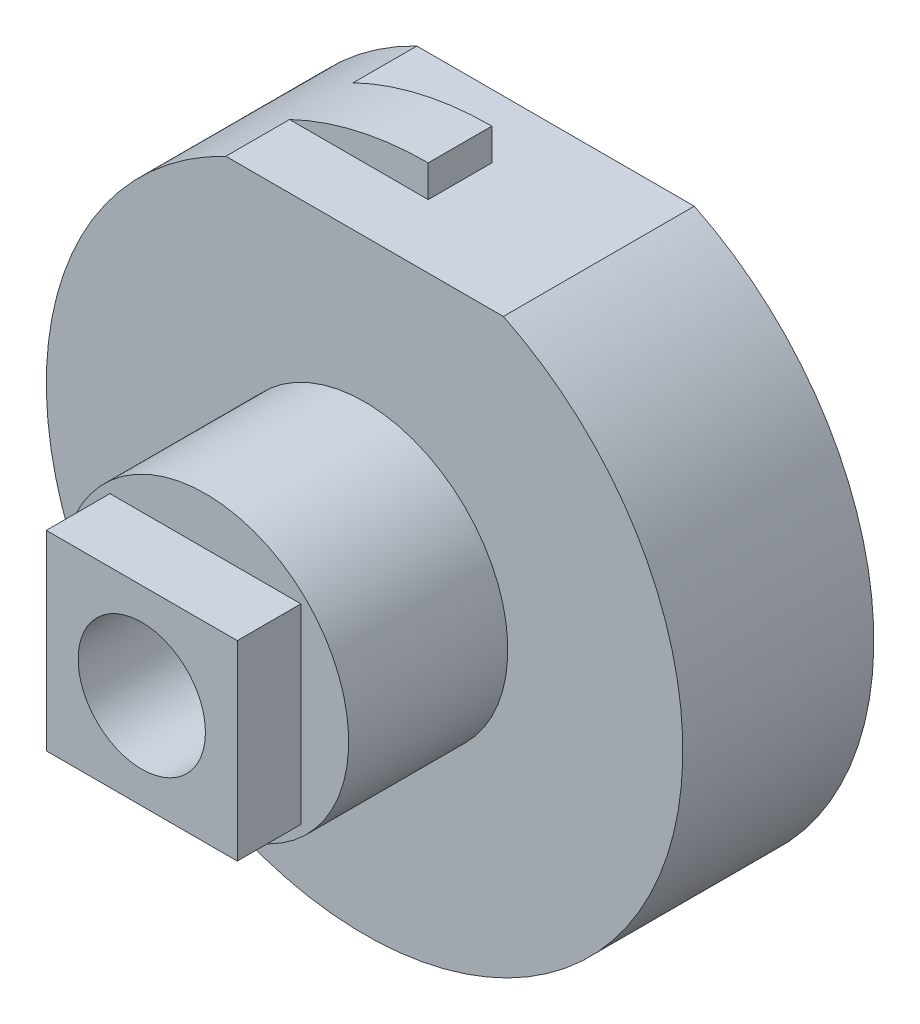
ISO-10303-21;
HEADER;
FILE_DESCRIPTION(('STEP AP214'),'2;1');
FILE_NAME('part.step','',(''),(''),'','','');
FILE_SCHEMA(('AUTOMOTIVE_DESIGN { 1 0 10303 214 1 1 1 1 }'));
ENDSEC;
DATA;
#1=APPLICATION_CONTEXT('core data for automotive mechanical design processes');
#2=APPLICATION_PROTOCOL_DEFINITION('international standard','automotive_design',2000,#1);
#3=PRODUCT_CONTEXT('',#1,'mechanical');
#4=PRODUCT('Part','Part','',(#3));
#5=PRODUCT_RELATED_PRODUCT_CATEGORY('part','',(#4));
#6=PRODUCT_DEFINITION_FORMATION('','',#4);
#7=PRODUCT_DEFINITION_CONTEXT('part definition',#1,'design');
#8=PRODUCT_DEFINITION('design','',#6,#7);
#9=PRODUCT_DEFINITION_SHAPE('','',#8);
#10=(LENGTH_UNIT() NAMED_UNIT(*) SI_UNIT(.MILLI.,.METRE.));
#11=(NAMED_UNIT(*) PLANE_ANGLE_UNIT() SI_UNIT($,.RADIAN.));
#12=(NAMED_UNIT(*) SI_UNIT($,.STERADIAN.) SOLID_ANGLE_UNIT());
#13=UNCERTAINTY_MEASURE_WITH_UNIT(LENGTH_MEASURE(1.E-05),#10,'distance_accuracy_value','');
#14=(GEOMETRIC_REPRESENTATION_CONTEXT(3) GLOBAL_UNCERTAINTY_ASSIGNED_CONTEXT((#13)) GLOBAL_UNIT_ASSIGNED_CONTEXT((#10,
#11,#12)) REPRESENTATION_CONTEXT('',''));
#15=CARTESIAN_POINT('',(0.,0.,0.));
#16=DIRECTION('',(0.,0.,1.));
#17=DIRECTION('',(1.,0.,0.));
#18=AXIS2_PLACEMENT_3D('',#15,#16,#17);
#19=CARTESIAN_POINT('',(0.,0.,-2.75));
#20=DIRECTION('',(0.,0.,-1.));
#21=DIRECTION('',(-1.,0.,0.));
#22=AXIS2_PLACEMENT_3D('',#19,#20,#21);
#23=PLANE('',#22);
#24=CARTESIAN_POINT('',(0.,0.,-2.75));
#25=DIRECTION('',(0.,0.,-1.));
#26=DIRECTION('',(-1.,0.,0.));
#27=AXIS2_PLACEMENT_3D('',#24,#25,#26);
#28=CIRCLE('',#27,1.25);
#29=CARTESIAN_POINT('',(-1.25,0.,-2.75));
#30=VERTEX_POINT('',#29);
#31=EDGE_CURVE('E185',#30,#30,#28,.T.);
#32=ORIENTED_EDGE('',*,*,#31,.F.);
#33=EDGE_LOOP('',(#32));
#34=FACE_BOUND('',#33,.T.);
#35=CARTESIAN_POINT('',(0.,0.,-2.75));
#36=DIRECTION('',(0.,0.,-1.));
#37=DIRECTION('',(-1.,0.,0.));
#38=AXIS2_PLACEMENT_3D('',#35,#36,#37);
#39=CIRCLE('',#38,2.5);
#40=CARTESIAN_POINT('',(1.08972473588517,2.25,-2.75));
#41=VERTEX_POINT('',#40);
#42=CARTESIAN_POINT('',(-1.08972473588517,2.25,-2.75));
#43=VERTEX_POINT('',#42);
#44=EDGE_CURVE('E194',#41,#43,#39,.T.);
#45=ORIENTED_EDGE('',*,*,#44,.T.);
#46=DIRECTION('',(-1.,0.,0.));
#47=VECTOR('',#46,1.);
#48=CARTESIAN_POINT('',(1.5,2.25,-2.75));
#49=LINE('',#48,#47);
#50=EDGE_CURVE('E294',#41,#43,#49,.T.);
#51=ORIENTED_EDGE('',*,*,#50,.F.);
#52=EDGE_LOOP('',(#45,#51));
#53=FACE_BOUND('',#52,.T.);
#54=ADVANCED_FACE('F36',(#34,#53),#23,.T.);
#55=CARTESIAN_POINT('',(0.,0.,-1.25));
#56=DIRECTION('',(0.,0.,-1.));
#57=DIRECTION('',(-1.,0.,0.));
#58=AXIS2_PLACEMENT_3D('',#55,#56,#57);
#59=PLANE('',#58);
#60=CARTESIAN_POINT('',(0.,0.,-1.25));
#61=DIRECTION('',(0.,0.,-1.));
#62=DIRECTION('',(-1.,0.,0.));
#63=AXIS2_PLACEMENT_3D('',#60,#61,#62);
#64=CIRCLE('',#63,1.125);
#65=CARTESIAN_POINT('',(-1.125,0.,-1.25));
#66=VERTEX_POINT('',#65);
#67=EDGE_CURVE('E116',#66,#66,#64,.T.);
#68=ORIENTED_EDGE('',*,*,#67,.T.);
#69=EDGE_LOOP('',(#68));
#70=FACE_BOUND('',#69,.T.);
#71=DIRECTION('',(1.,0.,0.));
#72=VECTOR('',#71,1.);
#73=CARTESIAN_POINT('',(1.5,2.25,-1.25));
#74=LINE('',#73,#72);
#75=CARTESIAN_POINT('',(-1.08972473588517,2.25,-1.25));
#76=VERTEX_POINT('',#75);
#77=CARTESIAN_POINT('',(1.08972473588517,2.25,-1.25));
#78=VERTEX_POINT('',#77);
#79=EDGE_CURVE('E53',#76,#78,#74,.T.);
#80=ORIENTED_EDGE('',*,*,#79,.F.);
#81=CARTESIAN_POINT('',(0.,0.,-1.25));
#82=DIRECTION('',(0.,0.,-1.));
#83=DIRECTION('',(-1.,0.,0.));
#84=AXIS2_PLACEMENT_3D('',#81,#82,#83);
#85=CIRCLE('',#84,2.5);
#86=EDGE_CURVE('E191',#78,#76,#85,.T.);
#87=ORIENTED_EDGE('',*,*,#86,.F.);
#88=EDGE_LOOP('',(#80,#87));
#89=FACE_BOUND('',#88,.T.);
#90=ADVANCED_FACE('F221',(#70,#89),#59,.F.);
#91=CARTESIAN_POINT('',(0.,0.,-2.75));
#92=DIRECTION('',(0.,0.,1.));
#93=DIRECTION('',(1.,0.,0.));
#94=AXIS2_PLACEMENT_3D('',#91,#92,#93);
#95=CYLINDRICAL_SURFACE('',#94,2.5);
#96=DIRECTION('',(0.,0.,1.));
#97=VECTOR('',#96,1.);
#98=CARTESIAN_POINT('',(-1.08972473588517,2.25,-2.75));
#99=LINE('',#98,#97);
#100=CARTESIAN_POINT('',(-1.08972473588517,2.25,-2.25));
#101=VERTEX_POINT('',#100);
#102=EDGE_CURVE('E11',#43,#101,#99,.T.);
#103=ORIENTED_EDGE('',*,*,#102,.F.);
#104=ORIENTED_EDGE('',*,*,#44,.F.);
#105=DIRECTION('',(0.,0.,1.));
#106=VECTOR('',#105,1.);
#107=CARTESIAN_POINT('',(1.08972473588517,2.25,-2.75));
#108=LINE('',#107,#106);
#109=EDGE_CURVE('E126',#78,#41,#108,.F.);
#110=ORIENTED_EDGE('',*,*,#109,.F.);
#111=ORIENTED_EDGE('',*,*,#86,.T.);
#112=CARTESIAN_POINT('',(-1.08972473588517,2.25,-1.75));
#113=VERTEX_POINT('',#112);
#114=EDGE_CURVE('E46',#113,#76,#99,.T.);
#115=ORIENTED_EDGE('',*,*,#114,.F.);
#116=CARTESIAN_POINT('',(0.,0.,-1.75));
#117=DIRECTION('',(0.,0.,1.));
#118=DIRECTION('',(1.,0.,0.));
#119=AXIS2_PLACEMENT_3D('',#116,#117,#118);
#120=CIRCLE('',#119,2.5);
#121=CARTESIAN_POINT('',(0.,2.5,-1.75));
#122=VERTEX_POINT('',#121);
#123=EDGE_CURVE('E128',#122,#113,#120,.T.);
#124=ORIENTED_EDGE('',*,*,#123,.F.);
#125=DIRECTION('',(0.,0.,1.));
#126=VECTOR('',#125,1.);
#127=CARTESIAN_POINT('',(0.,2.5,-2.75));
#128=LINE('',#127,#126);
#129=CARTESIAN_POINT('',(0.,2.5,-2.25));
#130=VERTEX_POINT('',#129);
#131=EDGE_CURVE('E130',#130,#122,#128,.T.);
#132=ORIENTED_EDGE('',*,*,#131,.F.);
#133=CARTESIAN_POINT('',(0.,0.,-2.25));
#134=DIRECTION('',(0.,0.,-1.));
#135=DIRECTION('',(-1.,0.,0.));
#136=AXIS2_PLACEMENT_3D('',#133,#134,#135);
#137=CIRCLE('',#136,2.5);
#138=EDGE_CURVE('E40',#101,#130,#137,.T.);
#139=ORIENTED_EDGE('',*,*,#138,.F.);
#140=EDGE_LOOP('',(#103,#104,#110,#111,#115,#124,#132,#139));
#141=FACE_BOUND('',#140,.T.);
#142=ADVANCED_FACE('F161',(#141),#95,.T.);
#143=CARTESIAN_POINT('',(0.,0.,-3.));
#144=DIRECTION('',(0.,0.,-1.));
#145=DIRECTION('',(-1.,0.,0.));
#146=AXIS2_PLACEMENT_3D('',#143,#144,#145);
#147=PLANE('',#146);
#148=CARTESIAN_POINT('',(0.,0.,-3.));
#149=DIRECTION('',(0.,0.,-1.));
#150=DIRECTION('',(-1.,0.,0.));
#151=AXIS2_PLACEMENT_3D('',#148,#149,#150);
#152=CIRCLE('',#151,1.25);
#153=CARTESIAN_POINT('',(-1.25,0.,-3.));
#154=VERTEX_POINT('',#153);
#155=EDGE_CURVE('E188',#154,#154,#152,.T.);
#156=ORIENTED_EDGE('',*,*,#155,.T.);
#157=EDGE_LOOP('',(#156));
#158=FACE_BOUND('',#157,.T.);
#159=CARTESIAN_POINT('',(0.,0.,-3.));
#160=DIRECTION('',(0.,0.,-1.));
#161=DIRECTION('',(-1.,0.,0.));
#162=AXIS2_PLACEMENT_3D('',#159,#160,#161);
#163=CIRCLE('',#162,0.5);
#164=CARTESIAN_POINT('',(-0.5,0.,-3.));
#165=VERTEX_POINT('',#164);
#166=EDGE_CURVE('E157',#165,#165,#163,.T.);
#167=ORIENTED_EDGE('',*,*,#166,.F.);
#168=EDGE_LOOP('',(#167));
#169=FACE_BOUND('',#168,.T.);
#170=ADVANCED_FACE('F234',(#158,#169),#147,.T.);
#171=CARTESIAN_POINT('',(-0.750000000000001,0.750000000000001,0.5));
#172=DIRECTION('',(1.,0.,0.));
#173=DIRECTION('',(0.,0.,-1.));
#174=AXIS2_PLACEMENT_3D('',#171,#172,#173);
#175=PLANE('',#174);
#176=DIRECTION('',(0.,-1.,0.));
#177=VECTOR('',#176,1.);
#178=CARTESIAN_POINT('',(-0.750000000000001,0.750000000000001,0.));
#179=LINE('',#178,#177);
#180=CARTESIAN_POINT('',(-0.750000000000001,0.750000000000001,0.));
#181=VERTEX_POINT('',#180);
#182=CARTESIAN_POINT('',(-0.750000000000001,-0.749999999999999,0.));
#183=VERTEX_POINT('',#182);
#184=EDGE_CURVE('E75',#181,#183,#179,.T.);
#185=ORIENTED_EDGE('',*,*,#184,.T.);
#186=DIRECTION('',(0.,0.,-1.));
#187=VECTOR('',#186,1.);
#188=CARTESIAN_POINT('',(-0.750000000000001,-0.749999999999999,0.5));
#189=LINE('',#188,#187);
#190=CARTESIAN_POINT('',(-0.750000000000001,-0.749999999999999,0.5));
#191=VERTEX_POINT('',#190);
#192=EDGE_CURVE('E105',#191,#183,#189,.T.);
#193=ORIENTED_EDGE('',*,*,#192,.F.);
#194=DIRECTION('',(0.,-1.,0.));
#195=VECTOR('',#194,1.);
#196=CARTESIAN_POINT('',(-0.750000000000001,0.750000000000001,0.5));
#197=LINE('',#196,#195);
#198=CARTESIAN_POINT('',(-0.750000000000001,0.750000000000001,0.5));
#199=VERTEX_POINT('',#198);
#200=EDGE_CURVE('E96',#199,#191,#197,.T.);
#201=ORIENTED_EDGE('',*,*,#200,.F.);
#202=DIRECTION('',(0.,0.,-1.));
#203=VECTOR('',#202,1.);
#204=CARTESIAN_POINT('',(-0.750000000000001,0.750000000000001,0.5));
#205=LINE('',#204,#203);
#206=EDGE_CURVE('E111',#199,#181,#205,.T.);
#207=ORIENTED_EDGE('',*,*,#206,.T.);
#208=EDGE_LOOP('',(#185,#193,#201,#207));
#209=FACE_BOUND('',#208,.T.);
#210=ADVANCED_FACE('F38',(#209),#175,.F.);
#211=CARTESIAN_POINT('',(-0.750000000000001,-0.749999999999999,0.5));
#212=DIRECTION('',(0.,1.,0.));
#213=DIRECTION('',(0.,0.,1.));
#214=AXIS2_PLACEMENT_3D('',#211,#212,#213);
#215=PLANE('',#214);
#216=DIRECTION('',(1.,0.,0.));
#217=VECTOR('',#216,1.);
#218=CARTESIAN_POINT('',(-0.750000000000001,-0.749999999999999,0.));
#219=LINE('',#218,#217);
#220=CARTESIAN_POINT('',(0.749999999999999,-0.749999999999999,0.));
#221=VERTEX_POINT('',#220);
#222=EDGE_CURVE('E83',#183,#221,#219,.T.);
#223=ORIENTED_EDGE('',*,*,#222,.T.);
#224=DIRECTION('',(0.,0.,-1.));
#225=VECTOR('',#224,1.);
#226=CARTESIAN_POINT('',(0.749999999999999,-0.749999999999999,0.5));
#227=LINE('',#226,#225);
#228=CARTESIAN_POINT('',(0.749999999999999,-0.749999999999999,0.5));
#229=VERTEX_POINT('',#228);
#230=EDGE_CURVE('E101',#229,#221,#227,.T.);
#231=ORIENTED_EDGE('',*,*,#230,.F.);
#232=DIRECTION('',(1.,0.,0.));
#233=VECTOR('',#232,1.);
#234=CARTESIAN_POINT('',(-0.750000000000001,-0.749999999999999,0.5));
#235=LINE('',#234,#233);
#236=EDGE_CURVE('E89',#191,#229,#235,.T.);
#237=ORIENTED_EDGE('',*,*,#236,.F.);
#238=ORIENTED_EDGE('',*,*,#192,.T.);
#239=EDGE_LOOP('',(#223,#231,#237,#238));
#240=FACE_BOUND('',#239,.T.);
#241=ADVANCED_FACE('F102',(#240),#215,.F.);
#242=CARTESIAN_POINT('',(0.749999999999999,0.750000000000001,0.5));
#243=DIRECTION('',(-1.,0.,0.));
#244=DIRECTION('',(0.,0.,1.));
#245=AXIS2_PLACEMENT_3D('',#242,#243,#244);
#246=PLANE('',#245);
#247=DIRECTION('',(0.,1.,0.));
#248=VECTOR('',#247,1.);
#249=CARTESIAN_POINT('',(0.749999999999999,0.750000000000001,0.));
#250=LINE('',#249,#248);
#251=CARTESIAN_POINT('',(0.749999999999999,0.750000000000001,0.));
#252=VERTEX_POINT('',#251);
#253=EDGE_CURVE('E118',#221,#252,#250,.T.);
#254=ORIENTED_EDGE('',*,*,#253,.T.);
#255=DIRECTION('',(0.,0.,-1.));
#256=VECTOR('',#255,1.);
#257=CARTESIAN_POINT('',(0.749999999999999,0.750000000000001,0.5));
#258=LINE('',#257,#256);
#259=CARTESIAN_POINT('',(0.749999999999999,0.750000000000001,0.5));
#260=VERTEX_POINT('',#259);
#261=EDGE_CURVE('E106',#260,#252,#258,.T.);
#262=ORIENTED_EDGE('',*,*,#261,.F.);
#263=DIRECTION('',(0.,1.,0.));
#264=VECTOR('',#263,1.);
#265=CARTESIAN_POINT('',(0.749999999999999,0.750000000000001,0.5));
#266=LINE('',#265,#264);
#267=EDGE_CURVE('E93',#229,#260,#266,.T.);
#268=ORIENTED_EDGE('',*,*,#267,.F.);
#269=ORIENTED_EDGE('',*,*,#230,.T.);
#270=EDGE_LOOP('',(#254,#262,#268,#269));
#271=FACE_BOUND('',#270,.T.);
#272=ADVANCED_FACE('F108',(#271),#246,.F.);
#273=CARTESIAN_POINT('',(-0.750000000000001,0.750000000000001,0.5));
#274=DIRECTION('',(0.,-1.,0.));
#275=DIRECTION('',(0.,0.,-1.));
#276=AXIS2_PLACEMENT_3D('',#273,#274,#275);
#277=PLANE('',#276);
#278=DIRECTION('',(-1.,0.,0.));
#279=VECTOR('',#278,1.);
#280=CARTESIAN_POINT('',(-0.750000000000001,0.750000000000001,0.));
#281=LINE('',#280,#279);
#282=EDGE_CURVE('E120',#252,#181,#281,.T.);
#283=ORIENTED_EDGE('',*,*,#282,.T.);
#284=ORIENTED_EDGE('',*,*,#206,.F.);
#285=DIRECTION('',(-1.,0.,0.));
#286=VECTOR('',#285,1.);
#287=CARTESIAN_POINT('',(-0.750000000000001,0.750000000000001,0.5));
#288=LINE('',#287,#286);
#289=EDGE_CURVE('E62',#260,#199,#288,.T.);
#290=ORIENTED_EDGE('',*,*,#289,.F.);
#291=ORIENTED_EDGE('',*,*,#261,.T.);
#292=EDGE_LOOP('',(#283,#284,#290,#291));
#293=FACE_BOUND('',#292,.T.);
#294=ADVANCED_FACE('F216',(#293),#277,.F.);
#295=CARTESIAN_POINT('',(-0.750000000000001,-0.749999999999999,0.5));
#296=DIRECTION('',(0.,0.,1.));
#297=DIRECTION('',(1.,0.,0.));
#298=AXIS2_PLACEMENT_3D('',#295,#296,#297);
#299=PLANE('',#298);
#300=CARTESIAN_POINT('',(0.,0.,0.5));
#301=DIRECTION('',(0.,0.,1.));
#302=DIRECTION('',(1.,0.,0.));
#303=AXIS2_PLACEMENT_3D('',#300,#301,#302);
#304=CIRCLE('',#303,0.5);
#305=CARTESIAN_POINT('',(0.5,0.,0.5));
#306=VERTEX_POINT('',#305);
#307=EDGE_CURVE('E284',#306,#306,#304,.T.);
#308=ORIENTED_EDGE('',*,*,#307,.F.);
#309=EDGE_LOOP('',(#308));
#310=FACE_BOUND('',#309,.T.);
#311=ORIENTED_EDGE('',*,*,#200,.T.);
#312=ORIENTED_EDGE('',*,*,#236,.T.);
#313=ORIENTED_EDGE('',*,*,#267,.T.);
#314=ORIENTED_EDGE('',*,*,#289,.T.);
#315=EDGE_LOOP('',(#311,#312,#313,#314));
#316=FACE_BOUND('',#315,.T.);
#317=ADVANCED_FACE('F91',(#310,#316),#299,.T.);
#318=CARTESIAN_POINT('',(0.,0.,0.));
#319=DIRECTION('',(0.,0.,-1.));
#320=DIRECTION('',(-1.,0.,0.));
#321=AXIS2_PLACEMENT_3D('',#318,#319,#320);
#322=PLANE('',#321);
#323=CARTESIAN_POINT('',(0.,0.,0.));
#324=DIRECTION('',(0.,0.,-1.));
#325=DIRECTION('',(-1.,0.,0.));
#326=AXIS2_PLACEMENT_3D('',#323,#324,#325);
#327=CIRCLE('',#326,1.125);
#328=CARTESIAN_POINT('',(-1.125,0.,0.));
#329=VERTEX_POINT('',#328);
#330=EDGE_CURVE('E197',#329,#329,#327,.T.);
#331=ORIENTED_EDGE('',*,*,#330,.F.);
#332=EDGE_LOOP('',(#331));
#333=FACE_BOUND('',#332,.T.);
#334=ORIENTED_EDGE('',*,*,#222,.F.);
#335=ORIENTED_EDGE('',*,*,#184,.F.);
#336=ORIENTED_EDGE('',*,*,#282,.F.);
#337=ORIENTED_EDGE('',*,*,#253,.F.);
#338=EDGE_LOOP('',(#334,#335,#336,#337));
#339=FACE_BOUND('',#338,.T.);
#340=ADVANCED_FACE('F206',(#333,#339),#322,.F.);
#341=CARTESIAN_POINT('',(0.,0.,-1.25));
#342=DIRECTION('',(0.,0.,1.));
#343=DIRECTION('',(1.,0.,0.));
#344=AXIS2_PLACEMENT_3D('',#341,#342,#343);
#345=CYLINDRICAL_SURFACE('',#344,1.125);
#346=ORIENTED_EDGE('',*,*,#67,.F.);
#347=EDGE_LOOP('',(#346));
#348=FACE_BOUND('',#347,.T.);
#349=ORIENTED_EDGE('',*,*,#330,.T.);
#350=EDGE_LOOP('',(#349));
#351=FACE_BOUND('',#350,.T.);
#352=ADVANCED_FACE('F204',(#348,#351),#345,.T.);
#353=CARTESIAN_POINT('',(0.,0.,-3.));
#354=DIRECTION('',(0.,0.,1.));
#355=DIRECTION('',(1.,0.,0.));
#356=AXIS2_PLACEMENT_3D('',#353,#354,#355);
#357=CYLINDRICAL_SURFACE('',#356,1.25);
#358=ORIENTED_EDGE('',*,*,#155,.F.);
#359=EDGE_LOOP('',(#358));
#360=FACE_BOUND('',#359,.T.);
#361=ORIENTED_EDGE('',*,*,#31,.T.);
#362=EDGE_LOOP('',(#361));
#363=FACE_BOUND('',#362,.T.);
#364=ADVANCED_FACE('F213',(#360,#363),#357,.T.);
#365=CARTESIAN_POINT('',(0.,0.,-3.5));
#366=DIRECTION('',(0.,0.,1.));
#367=DIRECTION('',(1.,0.,0.));
#368=AXIS2_PLACEMENT_3D('',#365,#366,#367);
#369=CYLINDRICAL_SURFACE('',#368,0.5);
#370=CARTESIAN_POINT('',(0.,0.,-3.5));
#371=DIRECTION('',(0.,0.,-1.));
#372=DIRECTION('',(-1.,0.,0.));
#373=AXIS2_PLACEMENT_3D('',#370,#371,#372);
#374=CIRCLE('',#373,0.5);
#375=CARTESIAN_POINT('',(-0.5,0.,-3.5));
#376=VERTEX_POINT('',#375);
#377=EDGE_CURVE('E182',#376,#376,#374,.T.);
#378=ORIENTED_EDGE('',*,*,#377,.F.);
#379=EDGE_LOOP('',(#378));
#380=FACE_BOUND('',#379,.T.);
#381=ORIENTED_EDGE('',*,*,#166,.T.);
#382=EDGE_LOOP('',(#381));
#383=FACE_BOUND('',#382,.T.);
#384=ADVANCED_FACE('F245',(#380,#383),#369,.T.);
#385=CARTESIAN_POINT('',(0.,0.,-3.5));
#386=DIRECTION('',(0.,0.,-1.));
#387=DIRECTION('',(-1.,0.,0.));
#388=AXIS2_PLACEMENT_3D('',#385,#386,#387);
#389=PLANE('',#388);
#390=ORIENTED_EDGE('',*,*,#377,.T.);
#391=EDGE_LOOP('',(#390));
#392=FACE_BOUND('',#391,.T.);
#393=ADVANCED_FACE('F248',(#392),#389,.T.);
#394=CARTESIAN_POINT('',(-1.5,12.25,-2.25));
#395=DIRECTION('',(0.,0.,-1.));
#396=DIRECTION('',(-1.,0.,0.));
#397=AXIS2_PLACEMENT_3D('',#394,#395,#396);
#398=PLANE('',#397);
#399=ORIENTED_EDGE('',*,*,#138,.T.);
#400=DIRECTION('',(0.,-1.,0.));
#401=VECTOR('',#400,1.);
#402=CARTESIAN_POINT('',(0.,12.25,-2.25));
#403=LINE('',#402,#401);
#404=CARTESIAN_POINT('',(0.,2.25,-2.25));
#405=VERTEX_POINT('',#404);
#406=EDGE_CURVE('E146',#130,#405,#403,.T.);
#407=ORIENTED_EDGE('',*,*,#406,.T.);
#408=DIRECTION('',(1.,0.,0.));
#409=VECTOR('',#408,1.);
#410=CARTESIAN_POINT('',(-1.5,2.25,-2.25));
#411=LINE('',#410,#409);
#412=EDGE_CURVE('E149',#101,#405,#411,.T.);
#413=ORIENTED_EDGE('',*,*,#412,.F.);
#414=EDGE_LOOP('',(#399,#407,#413));
#415=FACE_BOUND('',#414,.T.);
#416=ADVANCED_FACE('F144',(#415),#398,.T.);
#417=CARTESIAN_POINT('',(0.,12.25,-1.75));
#418=DIRECTION('',(1.,0.,0.));
#419=DIRECTION('',(0.,0.,-1.));
#420=AXIS2_PLACEMENT_3D('',#417,#418,#419);
#421=PLANE('',#420);
#422=ORIENTED_EDGE('',*,*,#131,.T.);
#423=DIRECTION('',(0.,-1.,0.));
#424=VECTOR('',#423,1.);
#425=CARTESIAN_POINT('',(0.,12.25,-1.75));
#426=LINE('',#425,#424);
#427=CARTESIAN_POINT('',(0.,2.25,-1.75));
#428=VERTEX_POINT('',#427);
#429=EDGE_CURVE('E158',#122,#428,#426,.T.);
#430=ORIENTED_EDGE('',*,*,#429,.T.);
#431=DIRECTION('',(0.,0.,1.));
#432=VECTOR('',#431,1.);
#433=CARTESIAN_POINT('',(0.,2.25,-1.75));
#434=LINE('',#433,#432);
#435=EDGE_CURVE('E156',#405,#428,#434,.T.);
#436=ORIENTED_EDGE('',*,*,#435,.F.);
#437=ORIENTED_EDGE('',*,*,#406,.F.);
#438=EDGE_LOOP('',(#422,#430,#436,#437));
#439=FACE_BOUND('',#438,.T.);
#440=ADVANCED_FACE('F154',(#439),#421,.T.);
#441=CARTESIAN_POINT('',(-1.5,12.25,-1.75));
#442=DIRECTION('',(0.,0.,1.));
#443=DIRECTION('',(1.,0.,0.));
#444=AXIS2_PLACEMENT_3D('',#441,#442,#443);
#445=PLANE('',#444);
#446=ORIENTED_EDGE('',*,*,#123,.T.);
#447=DIRECTION('',(-1.,0.,0.));
#448=VECTOR('',#447,1.);
#449=CARTESIAN_POINT('',(-1.5,2.25,-1.75));
#450=LINE('',#449,#448);
#451=EDGE_CURVE('E172',#428,#113,#450,.T.);
#452=ORIENTED_EDGE('',*,*,#451,.F.);
#453=ORIENTED_EDGE('',*,*,#429,.F.);
#454=EDGE_LOOP('',(#446,#452,#453));
#455=FACE_BOUND('',#454,.T.);
#456=ADVANCED_FACE('F170',(#455),#445,.T.);
#457=CARTESIAN_POINT('',(1.5,2.25,-2.75));
#458=DIRECTION('',(0.,1.,0.));
#459=DIRECTION('',(0.,0.,1.));
#460=AXIS2_PLACEMENT_3D('',#457,#458,#459);
#461=PLANE('',#460);
#462=ORIENTED_EDGE('',*,*,#102,.T.);
#463=ORIENTED_EDGE('',*,*,#412,.T.);
#464=ORIENTED_EDGE('',*,*,#435,.T.);
#465=ORIENTED_EDGE('',*,*,#451,.T.);
#466=ORIENTED_EDGE('',*,*,#114,.T.);
#467=ORIENTED_EDGE('',*,*,#79,.T.);
#468=ORIENTED_EDGE('',*,*,#109,.T.);
#469=ORIENTED_EDGE('',*,*,#50,.T.);
#470=EDGE_LOOP('',(#462,#463,#464,#465,#466,#467,#468,#469));
#471=FACE_BOUND('',#470,.T.);
#472=ADVANCED_FACE('F175',(#471),#461,.T.);
#473=CARTESIAN_POINT('',(0.,0.,-1.75));
#474=DIRECTION('',(0.,0.,1.));
#475=DIRECTION('',(1.,0.,0.));
#476=AXIS2_PLACEMENT_3D('',#473,#474,#475);
#477=CONICAL_SURFACE('',#476,0.374999999999999,1.02974425867665);
#478=CARTESIAN_POINT('',(0.,0.,-1.97532273213534));
#479=VERTEX_POINT('',#478);
#480=VERTEX_LOOP('',#479);
#481=FACE_BOUND('',#480,.T.);
#482=CARTESIAN_POINT('',(0.,0.,-1.75));
#483=DIRECTION('',(0.,0.,1.));
#484=DIRECTION('',(1.,0.,0.));
#485=AXIS2_PLACEMENT_3D('',#482,#483,#484);
#486=CIRCLE('',#485,0.374999999999999);
#487=CARTESIAN_POINT('',(0.374999999999999,0.,-1.75));
#488=VERTEX_POINT('',#487);
#489=EDGE_CURVE('E291',#488,#488,#486,.T.);
#490=ORIENTED_EDGE('',*,*,#489,.T.);
#491=EDGE_LOOP('',(#490));
#492=FACE_BOUND('',#491,.T.);
#493=ADVANCED_FACE('F261',(#481,#492),#477,.F.);
#494=CARTESIAN_POINT('',(0.,0.,0.5));
#495=DIRECTION('',(0.,0.,1.));
#496=DIRECTION('',(1.,0.,0.));
#497=AXIS2_PLACEMENT_3D('',#494,#495,#496);
#498=CYLINDRICAL_SURFACE('',#497,0.374999999999999);
#499=ORIENTED_EDGE('',*,*,#489,.F.);
#500=EDGE_LOOP('',(#499));
#501=FACE_BOUND('',#500,.T.);
#502=CARTESIAN_POINT('',(0.,0.,-1.5));
#503=DIRECTION('',(0.,0.,1.));
#504=DIRECTION('',(1.,0.,0.));
#505=AXIS2_PLACEMENT_3D('',#502,#503,#504);
#506=CIRCLE('',#505,0.374999999999999);
#507=CARTESIAN_POINT('',(0.374999999999999,0.,-1.5));
#508=VERTEX_POINT('',#507);
#509=EDGE_CURVE('E286',#508,#508,#506,.T.);
#510=ORIENTED_EDGE('',*,*,#509,.T.);
#511=EDGE_LOOP('',(#510));
#512=FACE_BOUND('',#511,.T.);
#513=ADVANCED_FACE('F264',(#501,#512),#498,.F.);
#514=CARTESIAN_POINT('',(0.374999999999999,0.,-1.5));
#515=DIRECTION('',(0.,0.,-1.));
#516=DIRECTION('',(-1.,0.,0.));
#517=AXIS2_PLACEMENT_3D('',#514,#515,#516);
#518=PLANE('',#517);
#519=ORIENTED_EDGE('',*,*,#509,.F.);
#520=EDGE_LOOP('',(#519));
#521=FACE_BOUND('',#520,.T.);
#522=CARTESIAN_POINT('',(0.,0.,-1.5));
#523=DIRECTION('',(0.,0.,1.));
#524=DIRECTION('',(1.,0.,0.));
#525=AXIS2_PLACEMENT_3D('',#522,#523,#524);
#526=CIRCLE('',#525,0.5);
#527=CARTESIAN_POINT('',(0.5,0.,-1.5));
#528=VERTEX_POINT('',#527);
#529=EDGE_CURVE('E281',#528,#528,#526,.T.);
#530=ORIENTED_EDGE('',*,*,#529,.T.);
#531=EDGE_LOOP('',(#530));
#532=FACE_BOUND('',#531,.T.);
#533=ADVANCED_FACE('F268',(#521,#532),#518,.F.);
#534=CARTESIAN_POINT('',(0.,0.,0.5));
#535=DIRECTION('',(0.,0.,1.));
#536=DIRECTION('',(1.,0.,0.));
#537=AXIS2_PLACEMENT_3D('',#534,#535,#536);
#538=CYLINDRICAL_SURFACE('',#537,0.5);
#539=ORIENTED_EDGE('',*,*,#529,.F.);
#540=EDGE_LOOP('',(#539));
#541=FACE_BOUND('',#540,.T.);
#542=ORIENTED_EDGE('',*,*,#307,.T.);
#543=EDGE_LOOP('',(#542));
#544=FACE_BOUND('',#543,.T.);
#545=ADVANCED_FACE('F272',(#541,#544),#538,.F.);
#546=CLOSED_SHELL('',(#54,#90,#142,#170,#210,#241,#272,#294,#317,#340,#352,#364,#384,#393,#416,
#440,#456,#472,#493,#513,#533,#545));
#547=MANIFOLD_SOLID_BREP('B2',#546);
#548=ADVANCED_BREP_SHAPE_REPRESENTATION('',(#18,#547),#14);
#549=SHAPE_DEFINITION_REPRESENTATION(#9,#548);
ENDSEC;
END-ISO-10303-21;
